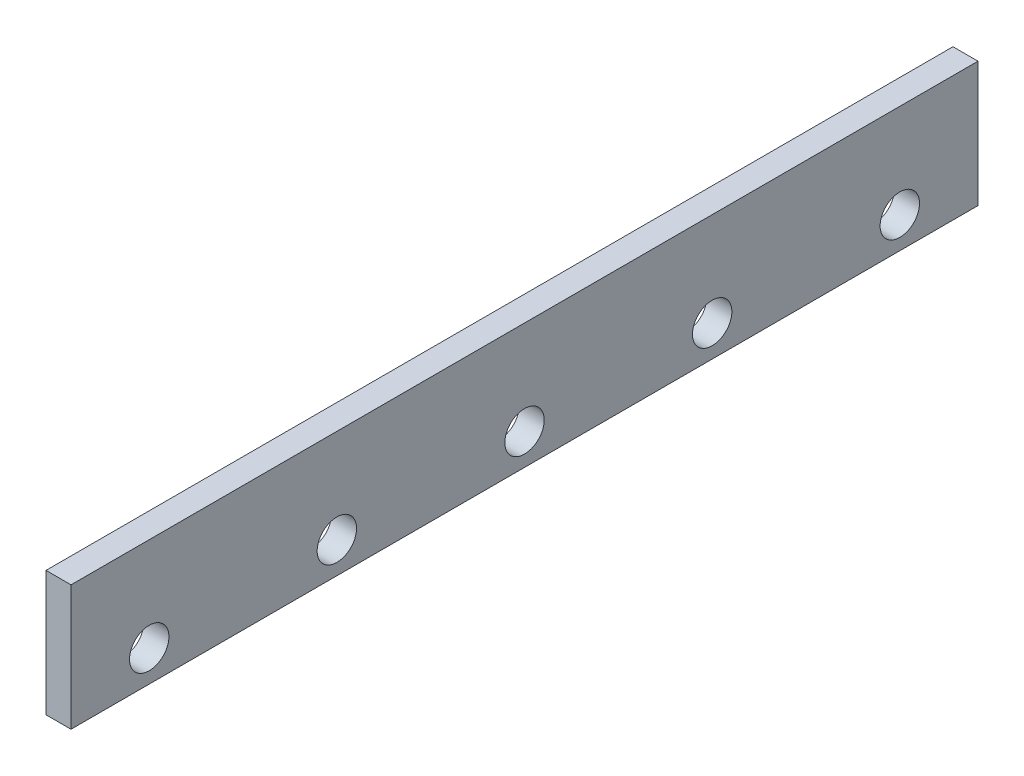
ISO-10303-21;
HEADER;
FILE_DESCRIPTION(('STEP AP214'),'2;1');
FILE_NAME('part.step','',(''),(''),'','','');
FILE_SCHEMA(('AUTOMOTIVE_DESIGN { 1 0 10303 214 1 1 1 1 }'));
ENDSEC;
DATA;
#1=APPLICATION_CONTEXT('core data for automotive mechanical design processes');
#2=APPLICATION_PROTOCOL_DEFINITION('international standard','automotive_design',2000,#1);
#3=PRODUCT_CONTEXT('',#1,'mechanical');
#4=PRODUCT('Part','Part','',(#3));
#5=PRODUCT_RELATED_PRODUCT_CATEGORY('part','',(#4));
#6=PRODUCT_DEFINITION_FORMATION('','',#4);
#7=PRODUCT_DEFINITION_CONTEXT('part definition',#1,'design');
#8=PRODUCT_DEFINITION('design','',#6,#7);
#9=PRODUCT_DEFINITION_SHAPE('','',#8);
#10=(LENGTH_UNIT() NAMED_UNIT(*) SI_UNIT(.MILLI.,.METRE.));
#11=(NAMED_UNIT(*) PLANE_ANGLE_UNIT() SI_UNIT($,.RADIAN.));
#12=(NAMED_UNIT(*) SI_UNIT($,.STERADIAN.) SOLID_ANGLE_UNIT());
#13=UNCERTAINTY_MEASURE_WITH_UNIT(LENGTH_MEASURE(1.E-05),#10,'distance_accuracy_value','');
#14=(GEOMETRIC_REPRESENTATION_CONTEXT(3) GLOBAL_UNCERTAINTY_ASSIGNED_CONTEXT((#13)) GLOBAL_UNIT_ASSIGNED_CONTEXT((#10,
#11,#12)) REPRESENTATION_CONTEXT('',''));
#15=CARTESIAN_POINT('',(0.,0.,0.));
#16=DIRECTION('',(0.,0.,1.));
#17=DIRECTION('',(1.,0.,0.));
#18=AXIS2_PLACEMENT_3D('',#15,#16,#17);
#19=CARTESIAN_POINT('',(16.,0.,0.));
#20=DIRECTION('',(-1.,0.,0.));
#21=DIRECTION('',(0.,0.,1.));
#22=AXIS2_PLACEMENT_3D('',#19,#20,#21);
#23=PLANE('',#22);
#24=DIRECTION('',(0.,-1.,0.));
#25=VECTOR('',#24,1.);
#26=CARTESIAN_POINT('',(16.,0.,0.));
#27=LINE('',#26,#25);
#28=CARTESIAN_POINT('',(16.,80.,0.));
#29=VERTEX_POINT('',#28);
#30=CARTESIAN_POINT('',(16.,0.,0.));
#31=VERTEX_POINT('',#30);
#32=EDGE_CURVE('E92',#29,#31,#27,.T.);
#33=ORIENTED_EDGE('',*,*,#32,.T.);
#34=DIRECTION('',(0.,0.,-1.));
#35=VECTOR('',#34,1.);
#36=CARTESIAN_POINT('',(16.,0.,0.));
#37=LINE('',#36,#35);
#38=CARTESIAN_POINT('',(16.,0.,-580.));
#39=VERTEX_POINT('',#38);
#40=EDGE_CURVE('E87',#31,#39,#37,.T.);
#41=ORIENTED_EDGE('',*,*,#40,.T.);
#42=DIRECTION('',(0.,1.,0.));
#43=VECTOR('',#42,1.);
#44=CARTESIAN_POINT('',(16.,0.,-580.));
#45=LINE('',#44,#43);
#46=CARTESIAN_POINT('',(16.,80.,-580.));
#47=VERTEX_POINT('',#46);
#48=EDGE_CURVE('E90',#39,#47,#45,.T.);
#49=ORIENTED_EDGE('',*,*,#48,.T.);
#50=DIRECTION('',(0.,0.,1.));
#51=VECTOR('',#50,1.);
#52=CARTESIAN_POINT('',(16.,80.,0.));
#53=LINE('',#52,#51);
#54=EDGE_CURVE('E57',#47,#29,#53,.T.);
#55=ORIENTED_EDGE('',*,*,#54,.T.);
#56=EDGE_LOOP('',(#33,#41,#49,#55));
#57=FACE_BOUND('',#56,.T.);
#58=CARTESIAN_POINT('',(16.,20.,-50.));
#59=DIRECTION('',(1.,0.,0.));
#60=DIRECTION('',(0.,0.,-1.));
#61=AXIS2_PLACEMENT_3D('',#58,#59,#60);
#62=CIRCLE('',#61,12.6);
#63=CARTESIAN_POINT('',(16.,20.,-62.6));
#64=VERTEX_POINT('',#63);
#65=EDGE_CURVE('E112',#64,#64,#62,.T.);
#66=ORIENTED_EDGE('',*,*,#65,.F.);
#67=EDGE_LOOP('',(#66));
#68=FACE_BOUND('',#67,.T.);
#69=CARTESIAN_POINT('',(16.,20.,-170.));
#70=DIRECTION('',(1.,0.,0.));
#71=DIRECTION('',(0.,0.,-1.));
#72=AXIS2_PLACEMENT_3D('',#69,#70,#71);
#73=CIRCLE('',#72,12.6);
#74=CARTESIAN_POINT('',(16.,20.,-182.6));
#75=VERTEX_POINT('',#74);
#76=EDGE_CURVE('E134',#75,#75,#73,.T.);
#77=ORIENTED_EDGE('',*,*,#76,.F.);
#78=EDGE_LOOP('',(#77));
#79=FACE_BOUND('',#78,.T.);
#80=CARTESIAN_POINT('',(16.,20.,-290.));
#81=DIRECTION('',(1.,0.,0.));
#82=DIRECTION('',(0.,0.,-1.));
#83=AXIS2_PLACEMENT_3D('',#80,#81,#82);
#84=CIRCLE('',#83,12.6);
#85=CARTESIAN_POINT('',(16.,20.,-302.6));
#86=VERTEX_POINT('',#85);
#87=EDGE_CURVE('E142',#86,#86,#84,.T.);
#88=ORIENTED_EDGE('',*,*,#87,.F.);
#89=EDGE_LOOP('',(#88));
#90=FACE_BOUND('',#89,.T.);
#91=CARTESIAN_POINT('',(16.,20.,-410.));
#92=DIRECTION('',(1.,0.,0.));
#93=DIRECTION('',(0.,0.,-1.));
#94=AXIS2_PLACEMENT_3D('',#91,#92,#93);
#95=CIRCLE('',#94,12.6);
#96=CARTESIAN_POINT('',(16.,20.,-422.6));
#97=VERTEX_POINT('',#96);
#98=EDGE_CURVE('E150',#97,#97,#95,.T.);
#99=ORIENTED_EDGE('',*,*,#98,.F.);
#100=EDGE_LOOP('',(#99));
#101=FACE_BOUND('',#100,.T.);
#102=CARTESIAN_POINT('',(16.,20.,-530.));
#103=DIRECTION('',(1.,0.,0.));
#104=DIRECTION('',(0.,0.,-1.));
#105=AXIS2_PLACEMENT_3D('',#102,#103,#104);
#106=CIRCLE('',#105,12.5999999999999);
#107=CARTESIAN_POINT('',(16.,20.,-542.6));
#108=VERTEX_POINT('',#107);
#109=EDGE_CURVE('E158',#108,#108,#106,.T.);
#110=ORIENTED_EDGE('',*,*,#109,.F.);
#111=EDGE_LOOP('',(#110));
#112=FACE_BOUND('',#111,.T.);
#113=ADVANCED_FACE('F39',(#57,#68,#79,#90,#101,#112),#23,.F.);
#114=CARTESIAN_POINT('',(0.,0.,0.));
#115=DIRECTION('',(-1.,0.,0.));
#116=DIRECTION('',(0.,0.,1.));
#117=AXIS2_PLACEMENT_3D('',#114,#115,#116);
#118=PLANE('',#117);
#119=CARTESIAN_POINT('',(0.,20.,-410.));
#120=DIRECTION('',(1.,0.,0.));
#121=DIRECTION('',(0.,0.,-1.));
#122=AXIS2_PLACEMENT_3D('',#119,#120,#121);
#123=CIRCLE('',#122,12.6);
#124=CARTESIAN_POINT('',(0.,20.,-422.6));
#125=VERTEX_POINT('',#124);
#126=EDGE_CURVE('E154',#125,#125,#123,.T.);
#127=ORIENTED_EDGE('',*,*,#126,.T.);
#128=EDGE_LOOP('',(#127));
#129=FACE_BOUND('',#128,.T.);
#130=CARTESIAN_POINT('',(0.,20.,-170.));
#131=DIRECTION('',(1.,0.,0.));
#132=DIRECTION('',(0.,0.,-1.));
#133=AXIS2_PLACEMENT_3D('',#130,#131,#132);
#134=CIRCLE('',#133,12.6);
#135=CARTESIAN_POINT('',(0.,20.,-182.6));
#136=VERTEX_POINT('',#135);
#137=EDGE_CURVE('E138',#136,#136,#134,.T.);
#138=ORIENTED_EDGE('',*,*,#137,.T.);
#139=EDGE_LOOP('',(#138));
#140=FACE_BOUND('',#139,.T.);
#141=DIRECTION('',(0.,-1.,0.));
#142=VECTOR('',#141,1.);
#143=CARTESIAN_POINT('',(0.,0.,0.));
#144=LINE('',#143,#142);
#145=CARTESIAN_POINT('',(0.,80.,0.));
#146=VERTEX_POINT('',#145);
#147=CARTESIAN_POINT('',(0.,0.,0.));
#148=VERTEX_POINT('',#147);
#149=EDGE_CURVE('E108',#146,#148,#144,.T.);
#150=ORIENTED_EDGE('',*,*,#149,.F.);
#151=DIRECTION('',(0.,0.,1.));
#152=VECTOR('',#151,1.);
#153=CARTESIAN_POINT('',(0.,80.,0.));
#154=LINE('',#153,#152);
#155=CARTESIAN_POINT('',(0.,80.,-580.));
#156=VERTEX_POINT('',#155);
#157=EDGE_CURVE('E80',#156,#146,#154,.T.);
#158=ORIENTED_EDGE('',*,*,#157,.F.);
#159=DIRECTION('',(0.,1.,0.));
#160=VECTOR('',#159,1.);
#161=CARTESIAN_POINT('',(0.,0.,-580.));
#162=LINE('',#161,#160);
#163=CARTESIAN_POINT('',(0.,0.,-580.));
#164=VERTEX_POINT('',#163);
#165=EDGE_CURVE('E74',#164,#156,#162,.T.);
#166=ORIENTED_EDGE('',*,*,#165,.F.);
#167=DIRECTION('',(0.,0.,-1.));
#168=VECTOR('',#167,1.);
#169=CARTESIAN_POINT('',(0.,0.,0.));
#170=LINE('',#169,#168);
#171=EDGE_CURVE('E97',#148,#164,#170,.T.);
#172=ORIENTED_EDGE('',*,*,#171,.F.);
#173=EDGE_LOOP('',(#150,#158,#166,#172));
#174=FACE_BOUND('',#173,.T.);
#175=CARTESIAN_POINT('',(0.,20.,-50.));
#176=DIRECTION('',(1.,0.,0.));
#177=DIRECTION('',(0.,0.,-1.));
#178=AXIS2_PLACEMENT_3D('',#175,#176,#177);
#179=CIRCLE('',#178,12.6);
#180=CARTESIAN_POINT('',(0.,20.,-62.6));
#181=VERTEX_POINT('',#180);
#182=EDGE_CURVE('E130',#181,#181,#179,.T.);
#183=ORIENTED_EDGE('',*,*,#182,.T.);
#184=EDGE_LOOP('',(#183));
#185=FACE_BOUND('',#184,.T.);
#186=CARTESIAN_POINT('',(0.,20.,-290.));
#187=DIRECTION('',(1.,0.,0.));
#188=DIRECTION('',(0.,0.,-1.));
#189=AXIS2_PLACEMENT_3D('',#186,#187,#188);
#190=CIRCLE('',#189,12.6);
#191=CARTESIAN_POINT('',(0.,20.,-302.6));
#192=VERTEX_POINT('',#191);
#193=EDGE_CURVE('E146',#192,#192,#190,.T.);
#194=ORIENTED_EDGE('',*,*,#193,.T.);
#195=EDGE_LOOP('',(#194));
#196=FACE_BOUND('',#195,.T.);
#197=CARTESIAN_POINT('',(0.,20.,-530.));
#198=DIRECTION('',(1.,0.,0.));
#199=DIRECTION('',(0.,0.,-1.));
#200=AXIS2_PLACEMENT_3D('',#197,#198,#199);
#201=CIRCLE('',#200,12.5999999999999);
#202=CARTESIAN_POINT('',(0.,20.,-542.6));
#203=VERTEX_POINT('',#202);
#204=EDGE_CURVE('E162',#203,#203,#201,.T.);
#205=ORIENTED_EDGE('',*,*,#204,.T.);
#206=EDGE_LOOP('',(#205));
#207=FACE_BOUND('',#206,.T.);
#208=ADVANCED_FACE('F125',(#129,#140,#174,#185,#196,#207),#118,.T.);
#209=CARTESIAN_POINT('',(16.,0.,0.));
#210=DIRECTION('',(0.,0.,-1.));
#211=DIRECTION('',(-1.,0.,0.));
#212=AXIS2_PLACEMENT_3D('',#209,#210,#211);
#213=PLANE('',#212);
#214=ORIENTED_EDGE('',*,*,#149,.T.);
#215=DIRECTION('',(-1.,0.,0.));
#216=VECTOR('',#215,1.);
#217=CARTESIAN_POINT('',(16.,0.,0.));
#218=LINE('',#217,#216);
#219=EDGE_CURVE('E11',#31,#148,#218,.T.);
#220=ORIENTED_EDGE('',*,*,#219,.F.);
#221=ORIENTED_EDGE('',*,*,#32,.F.);
#222=DIRECTION('',(-1.,0.,0.));
#223=VECTOR('',#222,1.);
#224=CARTESIAN_POINT('',(16.,80.,0.));
#225=LINE('',#224,#223);
#226=EDGE_CURVE('E104',#29,#146,#225,.T.);
#227=ORIENTED_EDGE('',*,*,#226,.T.);
#228=EDGE_LOOP('',(#214,#220,#221,#227));
#229=FACE_BOUND('',#228,.T.);
#230=ADVANCED_FACE('F41',(#229),#213,.F.);
#231=CARTESIAN_POINT('',(16.,0.,0.));
#232=DIRECTION('',(0.,1.,0.));
#233=DIRECTION('',(0.,0.,1.));
#234=AXIS2_PLACEMENT_3D('',#231,#232,#233);
#235=PLANE('',#234);
#236=ORIENTED_EDGE('',*,*,#171,.T.);
#237=DIRECTION('',(-1.,0.,0.));
#238=VECTOR('',#237,1.);
#239=CARTESIAN_POINT('',(16.,0.,-580.));
#240=LINE('',#239,#238);
#241=EDGE_CURVE('E49',#39,#164,#240,.T.);
#242=ORIENTED_EDGE('',*,*,#241,.F.);
#243=ORIENTED_EDGE('',*,*,#40,.F.);
#244=ORIENTED_EDGE('',*,*,#219,.T.);
#245=EDGE_LOOP('',(#236,#242,#243,#244));
#246=FACE_BOUND('',#245,.T.);
#247=ADVANCED_FACE('F96',(#246),#235,.F.);
#248=CARTESIAN_POINT('',(16.,0.,-580.));
#249=DIRECTION('',(0.,0.,1.));
#250=DIRECTION('',(1.,0.,0.));
#251=AXIS2_PLACEMENT_3D('',#248,#249,#250);
#252=PLANE('',#251);
#253=ORIENTED_EDGE('',*,*,#165,.T.);
#254=DIRECTION('',(-1.,0.,0.));
#255=VECTOR('',#254,1.);
#256=CARTESIAN_POINT('',(16.,80.,-580.));
#257=LINE('',#256,#255);
#258=EDGE_CURVE('E99',#47,#156,#257,.T.);
#259=ORIENTED_EDGE('',*,*,#258,.F.);
#260=ORIENTED_EDGE('',*,*,#48,.F.);
#261=ORIENTED_EDGE('',*,*,#241,.T.);
#262=EDGE_LOOP('',(#253,#259,#260,#261));
#263=FACE_BOUND('',#262,.T.);
#264=ADVANCED_FACE('F100',(#263),#252,.F.);
#265=CARTESIAN_POINT('',(16.,80.,0.));
#266=DIRECTION('',(0.,-1.,0.));
#267=DIRECTION('',(0.,0.,-1.));
#268=AXIS2_PLACEMENT_3D('',#265,#266,#267);
#269=PLANE('',#268);
#270=ORIENTED_EDGE('',*,*,#157,.T.);
#271=ORIENTED_EDGE('',*,*,#226,.F.);
#272=ORIENTED_EDGE('',*,*,#54,.F.);
#273=ORIENTED_EDGE('',*,*,#258,.T.);
#274=EDGE_LOOP('',(#270,#271,#272,#273));
#275=FACE_BOUND('',#274,.T.);
#276=ADVANCED_FACE('F122',(#275),#269,.F.);
#277=CARTESIAN_POINT('',(16.,20.,-50.));
#278=DIRECTION('',(-1.,0.,0.));
#279=DIRECTION('',(0.,0.,1.));
#280=AXIS2_PLACEMENT_3D('',#277,#278,#279);
#281=CYLINDRICAL_SURFACE('',#280,12.6);
#282=ORIENTED_EDGE('',*,*,#65,.T.);
#283=EDGE_LOOP('',(#282));
#284=FACE_BOUND('',#283,.T.);
#285=ORIENTED_EDGE('',*,*,#182,.F.);
#286=EDGE_LOOP('',(#285));
#287=FACE_BOUND('',#286,.T.);
#288=ADVANCED_FACE('F181',(#284,#287),#281,.F.);
#289=CARTESIAN_POINT('',(16.,20.,-170.));
#290=DIRECTION('',(-1.,0.,0.));
#291=DIRECTION('',(0.,0.,1.));
#292=AXIS2_PLACEMENT_3D('',#289,#290,#291);
#293=CYLINDRICAL_SURFACE('',#292,12.6);
#294=ORIENTED_EDGE('',*,*,#76,.T.);
#295=EDGE_LOOP('',(#294));
#296=FACE_BOUND('',#295,.T.);
#297=ORIENTED_EDGE('',*,*,#137,.F.);
#298=EDGE_LOOP('',(#297));
#299=FACE_BOUND('',#298,.T.);
#300=ADVANCED_FACE('F227',(#296,#299),#293,.F.);
#301=CARTESIAN_POINT('',(16.,20.,-290.));
#302=DIRECTION('',(-1.,0.,0.));
#303=DIRECTION('',(0.,0.,1.));
#304=AXIS2_PLACEMENT_3D('',#301,#302,#303);
#305=CYLINDRICAL_SURFACE('',#304,12.6);
#306=ORIENTED_EDGE('',*,*,#87,.T.);
#307=EDGE_LOOP('',(#306));
#308=FACE_BOUND('',#307,.T.);
#309=ORIENTED_EDGE('',*,*,#193,.F.);
#310=EDGE_LOOP('',(#309));
#311=FACE_BOUND('',#310,.T.);
#312=ADVANCED_FACE('F235',(#308,#311),#305,.F.);
#313=CARTESIAN_POINT('',(16.,20.,-410.));
#314=DIRECTION('',(-1.,0.,0.));
#315=DIRECTION('',(0.,0.,1.));
#316=AXIS2_PLACEMENT_3D('',#313,#314,#315);
#317=CYLINDRICAL_SURFACE('',#316,12.6);
#318=ORIENTED_EDGE('',*,*,#98,.T.);
#319=EDGE_LOOP('',(#318));
#320=FACE_BOUND('',#319,.T.);
#321=ORIENTED_EDGE('',*,*,#126,.F.);
#322=EDGE_LOOP('',(#321));
#323=FACE_BOUND('',#322,.T.);
#324=ADVANCED_FACE('F243',(#320,#323),#317,.F.);
#325=CARTESIAN_POINT('',(16.,20.,-530.));
#326=DIRECTION('',(-1.,0.,0.));
#327=DIRECTION('',(0.,0.,1.));
#328=AXIS2_PLACEMENT_3D('',#325,#326,#327);
#329=CYLINDRICAL_SURFACE('',#328,12.5999999999999);
#330=ORIENTED_EDGE('',*,*,#109,.T.);
#331=EDGE_LOOP('',(#330));
#332=FACE_BOUND('',#331,.T.);
#333=ORIENTED_EDGE('',*,*,#204,.F.);
#334=EDGE_LOOP('',(#333));
#335=FACE_BOUND('',#334,.T.);
#336=ADVANCED_FACE('F170',(#332,#335),#329,.F.);
#337=CLOSED_SHELL('',(#113,#208,#230,#247,#264,#276,#288,#300,#312,#324,#336));
#338=MANIFOLD_SOLID_BREP('B2',#337);
#339=ADVANCED_BREP_SHAPE_REPRESENTATION('',(#18,#338),#14);
#340=SHAPE_DEFINITION_REPRESENTATION(#9,#339);
ENDSEC;
END-ISO-10303-21;
